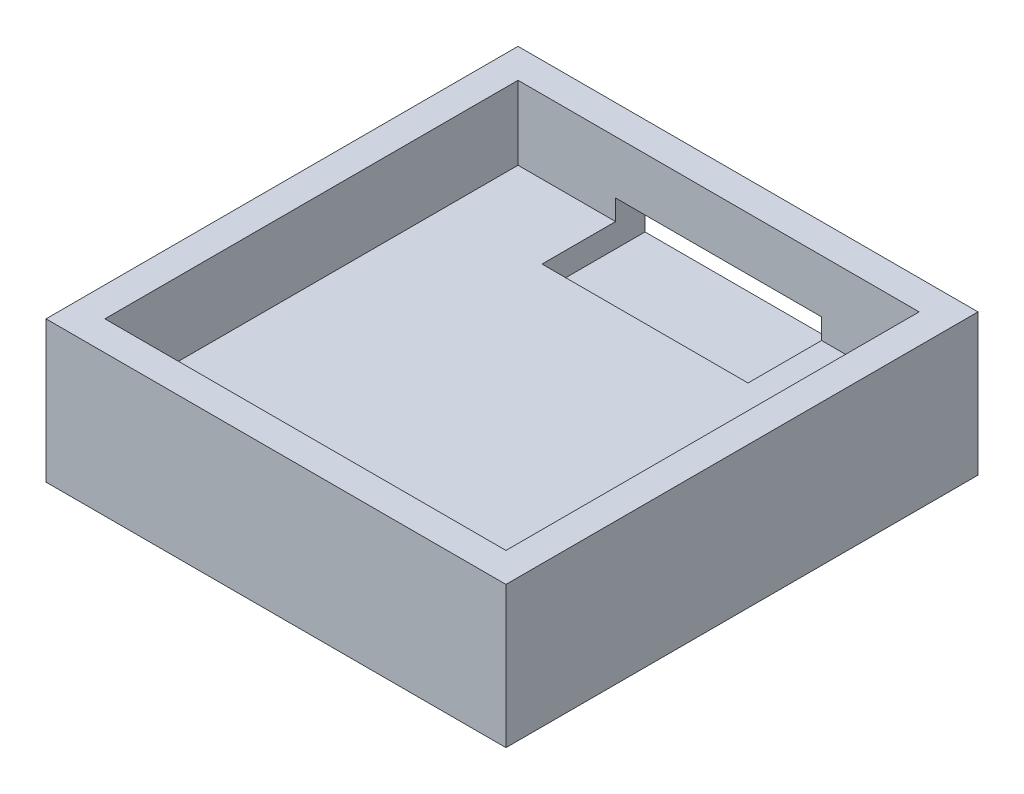
ISO-10303-21;
HEADER;
FILE_DESCRIPTION(('STEP AP214'),'2;1');
FILE_NAME('part.step','',(''),(''),'','','');
FILE_SCHEMA(('AUTOMOTIVE_DESIGN { 1 0 10303 214 1 1 1 1 }'));
ENDSEC;
DATA;
#1=APPLICATION_CONTEXT('core data for automotive mechanical design processes');
#2=APPLICATION_PROTOCOL_DEFINITION('international standard','automotive_design',2000,#1);
#3=PRODUCT_CONTEXT('',#1,'mechanical');
#4=PRODUCT('Part','Part','',(#3));
#5=PRODUCT_RELATED_PRODUCT_CATEGORY('part','',(#4));
#6=PRODUCT_DEFINITION_FORMATION('','',#4);
#7=PRODUCT_DEFINITION_CONTEXT('part definition',#1,'design');
#8=PRODUCT_DEFINITION('design','',#6,#7);
#9=PRODUCT_DEFINITION_SHAPE('','',#8);
#10=(LENGTH_UNIT() NAMED_UNIT(*) SI_UNIT(.MILLI.,.METRE.));
#11=(NAMED_UNIT(*) PLANE_ANGLE_UNIT() SI_UNIT($,.RADIAN.));
#12=(NAMED_UNIT(*) SI_UNIT($,.STERADIAN.) SOLID_ANGLE_UNIT());
#13=UNCERTAINTY_MEASURE_WITH_UNIT(LENGTH_MEASURE(1.E-05),#10,'distance_accuracy_value','');
#14=(GEOMETRIC_REPRESENTATION_CONTEXT(3) GLOBAL_UNCERTAINTY_ASSIGNED_CONTEXT((#13)) GLOBAL_UNIT_ASSIGNED_CONTEXT((#10,
#11,#12)) REPRESENTATION_CONTEXT('',''));
#15=CARTESIAN_POINT('',(0.,0.,0.));
#16=DIRECTION('',(0.,0.,1.));
#17=DIRECTION('',(1.,0.,0.));
#18=AXIS2_PLACEMENT_3D('',#15,#16,#17);
#19=CARTESIAN_POINT('',(-12.8282746478873,1.61,-9.71524647887324));
#20=DIRECTION('',(0.,0.,-1.));
#21=DIRECTION('',(-1.,0.,0.));
#22=AXIS2_PLACEMENT_3D('',#19,#20,#21);
#23=PLANE('',#22);
#24=DIRECTION('',(0.,-1.,0.));
#25=VECTOR('',#24,1.);
#26=CARTESIAN_POINT('',(18.4317253521127,1.61,-9.71524647887324));
#27=LINE('',#26,#25);
#28=CARTESIAN_POINT('',(18.4317253521127,6.61,-9.71524647887324));
#29=VERTEX_POINT('',#28);
#30=CARTESIAN_POINT('',(18.4317253521127,-3.,-9.71524647887324));
#31=VERTEX_POINT('',#30);
#32=EDGE_CURVE('E160',#29,#31,#27,.T.);
#33=ORIENTED_EDGE('',*,*,#32,.T.);
#34=DIRECTION('',(1.,0.,0.));
#35=VECTOR('',#34,1.);
#36=CARTESIAN_POINT('',(-12.8282746478873,-3.,-9.71524647887324));
#37=LINE('',#36,#35);
#38=CARTESIAN_POINT('',(-12.8282746478873,-3.,-9.71524647887324));
#39=VERTEX_POINT('',#38);
#40=EDGE_CURVE('E158',#39,#31,#37,.T.);
#41=ORIENTED_EDGE('',*,*,#40,.F.);
#42=DIRECTION('',(0.,-1.,0.));
#43=VECTOR('',#42,1.);
#44=CARTESIAN_POINT('',(-12.8282746478873,1.61,-9.71524647887324));
#45=LINE('',#44,#43);
#46=CARTESIAN_POINT('',(-12.8282746478873,6.61,-9.71524647887324));
#47=VERTEX_POINT('',#46);
#48=EDGE_CURVE('E143',#47,#39,#45,.T.);
#49=ORIENTED_EDGE('',*,*,#48,.F.);
#50=DIRECTION('',(-1.,0.,0.));
#51=VECTOR('',#50,1.);
#52=CARTESIAN_POINT('',(-12.8282746478873,6.61,-9.71524647887324));
#53=LINE('',#52,#51);
#54=EDGE_CURVE('E270',#29,#47,#53,.T.);
#55=ORIENTED_EDGE('',*,*,#54,.F.);
#56=EDGE_LOOP('',(#33,#41,#49,#55));
#57=FACE_BOUND('',#56,.T.);
#58=DIRECTION('',(1.,0.,0.));
#59=VECTOR('',#58,1.);
#60=CARTESIAN_POINT('',(-12.8282746478873,0.,-9.71524647887324));
#61=LINE('',#60,#59);
#62=CARTESIAN_POINT('',(-4.19827464788733,0.,-9.71524647887324));
#63=VERTEX_POINT('',#62);
#64=CARTESIAN_POINT('',(9.80172535211267,0.,-9.71524647887324));
#65=VERTEX_POINT('',#64);
#66=EDGE_CURVE('E172',#63,#65,#61,.T.);
#67=ORIENTED_EDGE('',*,*,#66,.T.);
#68=DIRECTION('',(0.,1.,0.));
#69=VECTOR('',#68,1.);
#70=CARTESIAN_POINT('',(9.80172535211267,0.,-9.71524647887324));
#71=LINE('',#70,#69);
#72=CARTESIAN_POINT('',(9.80172535211267,3.,-9.71524647887324));
#73=VERTEX_POINT('',#72);
#74=EDGE_CURVE('E194',#65,#73,#71,.T.);
#75=ORIENTED_EDGE('',*,*,#74,.T.);
#76=DIRECTION('',(-1.,0.,0.));
#77=VECTOR('',#76,1.);
#78=CARTESIAN_POINT('',(9.80172535211267,3.,-9.71524647887324));
#79=LINE('',#78,#77);
#80=CARTESIAN_POINT('',(-4.19827464788733,3.,-9.71524647887324));
#81=VERTEX_POINT('',#80);
#82=EDGE_CURVE('E190',#73,#81,#79,.T.);
#83=ORIENTED_EDGE('',*,*,#82,.T.);
#84=DIRECTION('',(0.,1.,0.));
#85=VECTOR('',#84,1.);
#86=CARTESIAN_POINT('',(-4.19827464788733,0.,-9.71524647887324));
#87=LINE('',#86,#85);
#88=EDGE_CURVE('E185',#63,#81,#87,.T.);
#89=ORIENTED_EDGE('',*,*,#88,.F.);
#90=EDGE_LOOP('',(#67,#75,#83,#89));
#91=FACE_BOUND('',#90,.T.);
#92=ADVANCED_FACE('F39',(#57,#91),#23,.T.);
#93=CARTESIAN_POINT('',(-10.8282746478873,6.61,-7.71524647887324));
#94=DIRECTION('',(0.,0.,1.));
#95=DIRECTION('',(1.,0.,0.));
#96=AXIS2_PLACEMENT_3D('',#93,#94,#95);
#97=PLANE('',#96);
#98=DIRECTION('',(1.,0.,0.));
#99=VECTOR('',#98,1.);
#100=CARTESIAN_POINT('',(-10.8282746478873,3.,-7.71524647887324));
#101=LINE('',#100,#99);
#102=CARTESIAN_POINT('',(-4.19827464788733,3.,-7.71524647887324));
#103=VERTEX_POINT('',#102);
#104=CARTESIAN_POINT('',(9.80172535211267,3.,-7.71524647887324));
#105=VERTEX_POINT('',#104);
#106=EDGE_CURVE('E47',#103,#105,#101,.T.);
#107=ORIENTED_EDGE('',*,*,#106,.T.);
#108=DIRECTION('',(0.,-1.,0.));
#109=VECTOR('',#108,1.);
#110=CARTESIAN_POINT('',(9.80172535211267,6.60999999999999,-7.71524647887324));
#111=LINE('',#110,#109);
#112=CARTESIAN_POINT('',(9.80172535211267,1.61,-7.71524647887324));
#113=VERTEX_POINT('',#112);
#114=EDGE_CURVE('E11',#105,#113,#111,.T.);
#115=ORIENTED_EDGE('',*,*,#114,.T.);
#116=DIRECTION('',(-1.,0.,0.));
#117=VECTOR('',#116,1.);
#118=CARTESIAN_POINT('',(-10.8282746478873,1.61,-7.71524647887324));
#119=LINE('',#118,#117);
#120=CARTESIAN_POINT('',(16.4317253521127,1.61,-7.71524647887324));
#121=VERTEX_POINT('',#120);
#122=EDGE_CURVE('E233',#121,#113,#119,.T.);
#123=ORIENTED_EDGE('',*,*,#122,.F.);
#124=DIRECTION('',(0.,-1.,0.));
#125=VECTOR('',#124,1.);
#126=CARTESIAN_POINT('',(16.4317253521127,6.61,-7.71524647887324));
#127=LINE('',#126,#125);
#128=CARTESIAN_POINT('',(16.4317253521127,6.61,-7.71524647887324));
#129=VERTEX_POINT('',#128);
#130=EDGE_CURVE('E62',#129,#121,#127,.T.);
#131=ORIENTED_EDGE('',*,*,#130,.F.);
#132=DIRECTION('',(-1.,0.,0.));
#133=VECTOR('',#132,1.);
#134=CARTESIAN_POINT('',(-10.8282746478873,6.61,-7.71524647887324));
#135=LINE('',#134,#133);
#136=CARTESIAN_POINT('',(-10.8282746478873,6.61,-7.71524647887324));
#137=VERTEX_POINT('',#136);
#138=EDGE_CURVE('E219',#129,#137,#135,.T.);
#139=ORIENTED_EDGE('',*,*,#138,.T.);
#140=DIRECTION('',(0.,-1.,0.));
#141=VECTOR('',#140,1.);
#142=CARTESIAN_POINT('',(-10.8282746478873,6.61,-7.71524647887324));
#143=LINE('',#142,#141);
#144=CARTESIAN_POINT('',(-10.8282746478873,1.61,-7.71524647887324));
#145=VERTEX_POINT('',#144);
#146=EDGE_CURVE('E256',#137,#145,#143,.T.);
#147=ORIENTED_EDGE('',*,*,#146,.T.);
#148=CARTESIAN_POINT('',(-4.19827464788733,1.61,-7.71524647887324));
#149=VERTEX_POINT('',#148);
#150=EDGE_CURVE('E216',#149,#145,#119,.T.);
#151=ORIENTED_EDGE('',*,*,#150,.F.);
#152=DIRECTION('',(0.,-1.,0.));
#153=VECTOR('',#152,1.);
#154=CARTESIAN_POINT('',(-4.19827464788733,6.61,-7.71524647887324));
#155=LINE('',#154,#153);
#156=EDGE_CURVE('E291',#103,#149,#155,.T.);
#157=ORIENTED_EDGE('',*,*,#156,.F.);
#158=EDGE_LOOP('',(#107,#115,#123,#131,#139,#147,#151,#157));
#159=FACE_BOUND('',#158,.T.);
#160=ADVANCED_FACE('F297',(#159),#97,.T.);
#161=CARTESIAN_POINT('',(0.,1.61,0.));
#162=DIRECTION('',(0.,-1.,0.));
#163=DIRECTION('',(0.,0.,-1.));
#164=AXIS2_PLACEMENT_3D('',#161,#162,#163);
#165=PLANE('',#164);
#166=DIRECTION('',(0.,0.,1.));
#167=VECTOR('',#166,1.);
#168=CARTESIAN_POINT('',(-4.19827464788733,1.61,-7.71524647887324));
#169=LINE('',#168,#167);
#170=CARTESIAN_POINT('',(-4.19827464788733,1.61,-2.71524647887324));
#171=VERTEX_POINT('',#170);
#172=EDGE_CURVE('E202',#149,#171,#169,.T.);
#173=ORIENTED_EDGE('',*,*,#172,.F.);
#174=ORIENTED_EDGE('',*,*,#150,.T.);
#175=DIRECTION('',(0.,0.,1.));
#176=VECTOR('',#175,1.);
#177=CARTESIAN_POINT('',(-10.8282746478873,1.61,-7.71524647887324));
#178=LINE('',#177,#176);
#179=CARTESIAN_POINT('',(-10.8282746478873,1.61,20.3647535211268));
#180=VERTEX_POINT('',#179);
#181=EDGE_CURVE('E237',#145,#180,#178,.T.);
#182=ORIENTED_EDGE('',*,*,#181,.T.);
#183=DIRECTION('',(1.,0.,0.));
#184=VECTOR('',#183,1.);
#185=CARTESIAN_POINT('',(-10.8282746478873,1.61,20.3647535211268));
#186=LINE('',#185,#184);
#187=CARTESIAN_POINT('',(16.4317253521127,1.61,20.3647535211268));
#188=VERTEX_POINT('',#187);
#189=EDGE_CURVE('E241',#180,#188,#186,.T.);
#190=ORIENTED_EDGE('',*,*,#189,.T.);
#191=DIRECTION('',(0.,0.,-1.));
#192=VECTOR('',#191,1.);
#193=CARTESIAN_POINT('',(16.4317253521127,1.61,-7.71524647887324));
#194=LINE('',#193,#192);
#195=EDGE_CURVE('E223',#188,#121,#194,.T.);
#196=ORIENTED_EDGE('',*,*,#195,.T.);
#197=ORIENTED_EDGE('',*,*,#122,.T.);
#198=DIRECTION('',(0.,0.,-1.));
#199=VECTOR('',#198,1.);
#200=CARTESIAN_POINT('',(9.80172535211267,1.61,-7.71524647887324));
#201=LINE('',#200,#199);
#202=CARTESIAN_POINT('',(9.80172535211267,1.61,-2.71524647887324));
#203=VERTEX_POINT('',#202);
#204=EDGE_CURVE('E209',#203,#113,#201,.T.);
#205=ORIENTED_EDGE('',*,*,#204,.F.);
#206=DIRECTION('',(1.,0.,0.));
#207=VECTOR('',#206,1.);
#208=CARTESIAN_POINT('',(-4.19827464788733,1.61,-2.71524647887324));
#209=LINE('',#208,#207);
#210=EDGE_CURVE('E54',#171,#203,#209,.T.);
#211=ORIENTED_EDGE('',*,*,#210,.F.);
#212=EDGE_LOOP('',(#173,#174,#182,#190,#196,#197,#205,#211));
#213=FACE_BOUND('',#212,.T.);
#214=ADVANCED_FACE('F314',(#213),#165,.F.);
#215=CARTESIAN_POINT('',(-12.8282746478873,1.61,-9.71524647887324));
#216=DIRECTION('',(1.,0.,0.));
#217=DIRECTION('',(0.,0.,-1.));
#218=AXIS2_PLACEMENT_3D('',#215,#216,#217);
#219=PLANE('',#218);
#220=ORIENTED_EDGE('',*,*,#48,.T.);
#221=DIRECTION('',(0.,0.,-1.));
#222=VECTOR('',#221,1.);
#223=CARTESIAN_POINT('',(-12.8282746478873,-3.,22.3647535211268));
#224=LINE('',#223,#222);
#225=CARTESIAN_POINT('',(-12.8282746478873,-3.,22.3647535211268));
#226=VERTEX_POINT('',#225);
#227=EDGE_CURVE('E147',#226,#39,#224,.T.);
#228=ORIENTED_EDGE('',*,*,#227,.F.);
#229=DIRECTION('',(0.,-1.,0.));
#230=VECTOR('',#229,1.);
#231=CARTESIAN_POINT('',(-12.8282746478873,1.61,22.3647535211268));
#232=LINE('',#231,#230);
#233=CARTESIAN_POINT('',(-12.8282746478873,6.61,22.3647535211268));
#234=VERTEX_POINT('',#233);
#235=EDGE_CURVE('E155',#234,#226,#232,.T.);
#236=ORIENTED_EDGE('',*,*,#235,.F.);
#237=DIRECTION('',(0.,0.,1.));
#238=VECTOR('',#237,1.);
#239=CARTESIAN_POINT('',(-12.8282746478873,6.61,-9.71524647887324));
#240=LINE('',#239,#238);
#241=EDGE_CURVE('E149',#47,#234,#240,.T.);
#242=ORIENTED_EDGE('',*,*,#241,.F.);
#243=EDGE_LOOP('',(#220,#228,#236,#242));
#244=FACE_BOUND('',#243,.T.);
#245=ADVANCED_FACE('F145',(#244),#219,.F.);
#246=CARTESIAN_POINT('',(-12.8282746478873,1.61,22.3647535211268));
#247=DIRECTION('',(0.,0.,-1.));
#248=DIRECTION('',(-1.,0.,0.));
#249=AXIS2_PLACEMENT_3D('',#246,#247,#248);
#250=PLANE('',#249);
#251=ORIENTED_EDGE('',*,*,#235,.T.);
#252=DIRECTION('',(-1.,0.,0.));
#253=VECTOR('',#252,1.);
#254=CARTESIAN_POINT('',(-12.8282746478873,-3.,22.3647535211268));
#255=LINE('',#254,#253);
#256=CARTESIAN_POINT('',(18.4317253521127,-3.,22.3647535211268));
#257=VERTEX_POINT('',#256);
#258=EDGE_CURVE('E170',#257,#226,#255,.T.);
#259=ORIENTED_EDGE('',*,*,#258,.F.);
#260=DIRECTION('',(0.,-1.,0.));
#261=VECTOR('',#260,1.);
#262=CARTESIAN_POINT('',(18.4317253521127,1.61,22.3647535211268));
#263=LINE('',#262,#261);
#264=CARTESIAN_POINT('',(18.4317253521127,6.61,22.3647535211268));
#265=VERTEX_POINT('',#264);
#266=EDGE_CURVE('E275',#265,#257,#263,.T.);
#267=ORIENTED_EDGE('',*,*,#266,.F.);
#268=DIRECTION('',(1.,0.,0.));
#269=VECTOR('',#268,1.);
#270=CARTESIAN_POINT('',(-12.8282746478873,6.61,22.3647535211268));
#271=LINE('',#270,#269);
#272=EDGE_CURVE('E262',#234,#265,#271,.T.);
#273=ORIENTED_EDGE('',*,*,#272,.F.);
#274=EDGE_LOOP('',(#251,#259,#267,#273));
#275=FACE_BOUND('',#274,.T.);
#276=ADVANCED_FACE('F364',(#275),#250,.F.);
#277=CARTESIAN_POINT('',(18.4317253521127,1.61,-9.71524647887324));
#278=DIRECTION('',(1.,0.,0.));
#279=DIRECTION('',(0.,0.,-1.));
#280=AXIS2_PLACEMENT_3D('',#277,#278,#279);
#281=PLANE('',#280);
#282=ORIENTED_EDGE('',*,*,#266,.T.);
#283=DIRECTION('',(0.,0.,1.));
#284=VECTOR('',#283,1.);
#285=CARTESIAN_POINT('',(18.4317253521127,-3.,22.3647535211268));
#286=LINE('',#285,#284);
#287=EDGE_CURVE('E165',#31,#257,#286,.T.);
#288=ORIENTED_EDGE('',*,*,#287,.F.);
#289=ORIENTED_EDGE('',*,*,#32,.F.);
#290=DIRECTION('',(0.,0.,-1.));
#291=VECTOR('',#290,1.);
#292=CARTESIAN_POINT('',(18.4317253521127,6.61,-9.71524647887324));
#293=LINE('',#292,#291);
#294=EDGE_CURVE('E266',#265,#29,#293,.T.);
#295=ORIENTED_EDGE('',*,*,#294,.F.);
#296=EDGE_LOOP('',(#282,#288,#289,#295));
#297=FACE_BOUND('',#296,.T.);
#298=ADVANCED_FACE('F359',(#297),#281,.T.);
#299=CARTESIAN_POINT('',(0.,6.61,0.));
#300=DIRECTION('',(0.,1.,0.));
#301=DIRECTION('',(0.,0.,1.));
#302=AXIS2_PLACEMENT_3D('',#299,#300,#301);
#303=PLANE('',#302);
#304=ORIENTED_EDGE('',*,*,#241,.T.);
#305=ORIENTED_EDGE('',*,*,#272,.T.);
#306=ORIENTED_EDGE('',*,*,#294,.T.);
#307=ORIENTED_EDGE('',*,*,#54,.T.);
#308=EDGE_LOOP('',(#304,#305,#306,#307));
#309=FACE_BOUND('',#308,.T.);
#310=DIRECTION('',(0.,0.,1.));
#311=VECTOR('',#310,1.);
#312=CARTESIAN_POINT('',(-10.8282746478873,6.61,-7.71524647887324));
#313=LINE('',#312,#311);
#314=CARTESIAN_POINT('',(-10.8282746478873,6.61,20.3647535211268));
#315=VERTEX_POINT('',#314);
#316=EDGE_CURVE('E222',#137,#315,#313,.T.);
#317=ORIENTED_EDGE('',*,*,#316,.F.);
#318=ORIENTED_EDGE('',*,*,#138,.F.);
#319=DIRECTION('',(0.,0.,-1.));
#320=VECTOR('',#319,1.);
#321=CARTESIAN_POINT('',(16.4317253521127,6.61,-7.71524647887324));
#322=LINE('',#321,#320);
#323=CARTESIAN_POINT('',(16.4317253521127,6.61,20.3647535211268));
#324=VERTEX_POINT('',#323);
#325=EDGE_CURVE('E230',#324,#129,#322,.T.);
#326=ORIENTED_EDGE('',*,*,#325,.F.);
#327=DIRECTION('',(1.,0.,0.));
#328=VECTOR('',#327,1.);
#329=CARTESIAN_POINT('',(-10.8282746478873,6.61,20.3647535211268));
#330=LINE('',#329,#328);
#331=EDGE_CURVE('E226',#315,#324,#330,.T.);
#332=ORIENTED_EDGE('',*,*,#331,.F.);
#333=EDGE_LOOP('',(#317,#318,#326,#332));
#334=FACE_BOUND('',#333,.T.);
#335=ADVANCED_FACE('F320',(#309,#334),#303,.T.);
#336=CARTESIAN_POINT('',(-10.8282746478873,6.61,-7.71524647887324));
#337=DIRECTION('',(1.,0.,0.));
#338=DIRECTION('',(0.,0.,-1.));
#339=AXIS2_PLACEMENT_3D('',#336,#337,#338);
#340=PLANE('',#339);
#341=ORIENTED_EDGE('',*,*,#181,.F.);
#342=ORIENTED_EDGE('',*,*,#146,.F.);
#343=ORIENTED_EDGE('',*,*,#316,.T.);
#344=DIRECTION('',(0.,-1.,0.));
#345=VECTOR('',#344,1.);
#346=CARTESIAN_POINT('',(-10.8282746478873,6.61,20.3647535211268));
#347=LINE('',#346,#345);
#348=EDGE_CURVE('E253',#315,#180,#347,.T.);
#349=ORIENTED_EDGE('',*,*,#348,.T.);
#350=EDGE_LOOP('',(#341,#342,#343,#349));
#351=FACE_BOUND('',#350,.T.);
#352=ADVANCED_FACE('F325',(#351),#340,.T.);
#353=CARTESIAN_POINT('',(-10.8282746478873,6.61,20.3647535211268));
#354=DIRECTION('',(0.,0.,-1.));
#355=DIRECTION('',(-1.,0.,0.));
#356=AXIS2_PLACEMENT_3D('',#353,#354,#355);
#357=PLANE('',#356);
#358=ORIENTED_EDGE('',*,*,#189,.F.);
#359=ORIENTED_EDGE('',*,*,#348,.F.);
#360=ORIENTED_EDGE('',*,*,#331,.T.);
#361=DIRECTION('',(0.,-1.,0.));
#362=VECTOR('',#361,1.);
#363=CARTESIAN_POINT('',(16.4317253521127,6.61,20.3647535211268));
#364=LINE('',#363,#362);
#365=EDGE_CURVE('E250',#324,#188,#364,.T.);
#366=ORIENTED_EDGE('',*,*,#365,.T.);
#367=EDGE_LOOP('',(#358,#359,#360,#366));
#368=FACE_BOUND('',#367,.T.);
#369=ADVANCED_FACE('F328',(#368),#357,.T.);
#370=CARTESIAN_POINT('',(16.4317253521127,6.61,-7.71524647887324));
#371=DIRECTION('',(-1.,0.,0.));
#372=DIRECTION('',(0.,0.,1.));
#373=AXIS2_PLACEMENT_3D('',#370,#371,#372);
#374=PLANE('',#373);
#375=ORIENTED_EDGE('',*,*,#195,.F.);
#376=ORIENTED_EDGE('',*,*,#365,.F.);
#377=ORIENTED_EDGE('',*,*,#325,.T.);
#378=ORIENTED_EDGE('',*,*,#130,.T.);
#379=EDGE_LOOP('',(#375,#376,#377,#378));
#380=FACE_BOUND('',#379,.T.);
#381=ADVANCED_FACE('F391',(#380),#374,.T.);
#382=CARTESIAN_POINT('',(-4.19827464788733,-3.39,-7.71524647887324));
#383=DIRECTION('',(-1.,0.,0.));
#384=DIRECTION('',(0.,0.,1.));
#385=AXIS2_PLACEMENT_3D('',#382,#383,#384);
#386=PLANE('',#385);
#387=ORIENTED_EDGE('',*,*,#172,.T.);
#388=DIRECTION('',(0.,1.,0.));
#389=VECTOR('',#388,1.);
#390=CARTESIAN_POINT('',(-4.19827464788733,-3.39,-2.71524647887324));
#391=LINE('',#390,#389);
#392=CARTESIAN_POINT('',(-4.19827464788733,0.,-2.71524647887324));
#393=VERTEX_POINT('',#392);
#394=EDGE_CURVE('E212',#393,#171,#391,.T.);
#395=ORIENTED_EDGE('',*,*,#394,.F.);
#396=DIRECTION('',(0.,0.,-1.));
#397=VECTOR('',#396,1.);
#398=CARTESIAN_POINT('',(-4.19827464788733,0.,0.));
#399=LINE('',#398,#397);
#400=EDGE_CURVE('E287',#393,#63,#399,.T.);
#401=ORIENTED_EDGE('',*,*,#400,.T.);
#402=ORIENTED_EDGE('',*,*,#88,.T.);
#403=DIRECTION('',(0.,0.,-1.));
#404=VECTOR('',#403,1.);
#405=CARTESIAN_POINT('',(-4.19827464788733,3.,-4.71524647887324));
#406=LINE('',#405,#404);
#407=EDGE_CURVE('E198',#103,#81,#406,.T.);
#408=ORIENTED_EDGE('',*,*,#407,.F.);
#409=ORIENTED_EDGE('',*,*,#156,.T.);
#410=EDGE_LOOP('',(#387,#395,#401,#402,#408,#409));
#411=FACE_BOUND('',#410,.T.);
#412=ADVANCED_FACE('F305',(#411),#386,.F.);
#413=CARTESIAN_POINT('',(9.80172535211267,-3.39,-7.71524647887324));
#414=DIRECTION('',(1.,0.,0.));
#415=DIRECTION('',(0.,0.,-1.));
#416=AXIS2_PLACEMENT_3D('',#413,#414,#415);
#417=PLANE('',#416);
#418=DIRECTION('',(0.,0.,1.));
#419=VECTOR('',#418,1.);
#420=CARTESIAN_POINT('',(9.80172535211267,0.,0.));
#421=LINE('',#420,#419);
#422=CARTESIAN_POINT('',(9.80172535211267,0.,-2.71524647887324));
#423=VERTEX_POINT('',#422);
#424=EDGE_CURVE('E283',#65,#423,#421,.T.);
#425=ORIENTED_EDGE('',*,*,#424,.T.);
#426=DIRECTION('',(0.,1.,0.));
#427=VECTOR('',#426,1.);
#428=CARTESIAN_POINT('',(9.80172535211267,-3.39,-2.71524647887324));
#429=LINE('',#428,#427);
#430=EDGE_CURVE('E213',#423,#203,#429,.T.);
#431=ORIENTED_EDGE('',*,*,#430,.T.);
#432=ORIENTED_EDGE('',*,*,#204,.T.);
#433=ORIENTED_EDGE('',*,*,#114,.F.);
#434=DIRECTION('',(0.,0.,-1.));
#435=VECTOR('',#434,1.);
#436=CARTESIAN_POINT('',(9.80172535211267,3.,-4.71524647887324));
#437=LINE('',#436,#435);
#438=EDGE_CURVE('E199',#105,#73,#437,.T.);
#439=ORIENTED_EDGE('',*,*,#438,.T.);
#440=ORIENTED_EDGE('',*,*,#74,.F.);
#441=EDGE_LOOP('',(#425,#431,#432,#433,#439,#440));
#442=FACE_BOUND('',#441,.T.);
#443=ADVANCED_FACE('F311',(#442),#417,.F.);
#444=CARTESIAN_POINT('',(-4.19827464788733,-3.39,-2.71524647887324));
#445=DIRECTION('',(0.,0.,1.));
#446=DIRECTION('',(1.,0.,0.));
#447=AXIS2_PLACEMENT_3D('',#444,#445,#446);
#448=PLANE('',#447);
#449=DIRECTION('',(-1.,0.,0.));
#450=VECTOR('',#449,1.);
#451=CARTESIAN_POINT('',(0.,0.,-2.71524647887324));
#452=LINE('',#451,#450);
#453=EDGE_CURVE('E154',#423,#393,#452,.T.);
#454=ORIENTED_EDGE('',*,*,#453,.T.);
#455=ORIENTED_EDGE('',*,*,#394,.T.);
#456=ORIENTED_EDGE('',*,*,#210,.T.);
#457=ORIENTED_EDGE('',*,*,#430,.F.);
#458=EDGE_LOOP('',(#454,#455,#456,#457));
#459=FACE_BOUND('',#458,.T.);
#460=ADVANCED_FACE('F330',(#459),#448,.F.);
#461=CARTESIAN_POINT('',(9.80172535211267,3.,-4.71524647887324));
#462=DIRECTION('',(0.,-1.,0.));
#463=DIRECTION('',(0.,0.,-1.));
#464=AXIS2_PLACEMENT_3D('',#461,#462,#463);
#465=PLANE('',#464);
#466=ORIENTED_EDGE('',*,*,#407,.T.);
#467=ORIENTED_EDGE('',*,*,#82,.F.);
#468=ORIENTED_EDGE('',*,*,#438,.F.);
#469=ORIENTED_EDGE('',*,*,#106,.F.);
#470=EDGE_LOOP('',(#466,#467,#468,#469));
#471=FACE_BOUND('',#470,.T.);
#472=ADVANCED_FACE('F302',(#471),#465,.T.);
#473=CARTESIAN_POINT('',(0.,-3.,0.));
#474=DIRECTION('',(0.,-1.,0.));
#475=DIRECTION('',(0.,0.,-1.));
#476=AXIS2_PLACEMENT_3D('',#473,#474,#475);
#477=PLANE('',#476);
#478=CARTESIAN_POINT('',(2.80172535211267,-3.,15.6447535211268));
#479=DIRECTION('',(0.,-1.,0.));
#480=DIRECTION('',(0.,0.,-1.));
#481=AXIS2_PLACEMENT_3D('',#478,#479,#480);
#482=CIRCLE('',#481,2.5);
#483=CARTESIAN_POINT('',(2.80172535211267,-3.,13.1447535211268));
#484=VERTEX_POINT('',#483);
#485=EDGE_CURVE('E508',#484,#484,#482,.T.);
#486=ORIENTED_EDGE('',*,*,#485,.F.);
#487=EDGE_LOOP('',(#486));
#488=FACE_BOUND('',#487,.T.);
#489=CARTESIAN_POINT('',(11.1017253521127,-3.,6.32475352112676));
#490=DIRECTION('',(0.,-1.,0.));
#491=DIRECTION('',(0.,0.,-1.));
#492=AXIS2_PLACEMENT_3D('',#489,#490,#491);
#493=CIRCLE('',#492,2.5);
#494=CARTESIAN_POINT('',(11.1017253521127,-3.,3.82475352112676));
#495=VERTEX_POINT('',#494);
#496=EDGE_CURVE('E518',#495,#495,#493,.T.);
#497=ORIENTED_EDGE('',*,*,#496,.F.);
#498=EDGE_LOOP('',(#497));
#499=FACE_BOUND('',#498,.T.);
#500=CARTESIAN_POINT('',(-5.49827464788733,-3.,6.32475352112676));
#501=DIRECTION('',(0.,-1.,0.));
#502=DIRECTION('',(0.,0.,-1.));
#503=AXIS2_PLACEMENT_3D('',#500,#501,#502);
#504=CIRCLE('',#503,2.5);
#505=CARTESIAN_POINT('',(-5.49827464788733,-3.,3.82475352112676));
#506=VERTEX_POINT('',#505);
#507=EDGE_CURVE('E526',#506,#506,#504,.T.);
#508=ORIENTED_EDGE('',*,*,#507,.F.);
#509=EDGE_LOOP('',(#508));
#510=FACE_BOUND('',#509,.T.);
#511=CARTESIAN_POINT('',(2.80172535211267,-3.,-2.99524647887324));
#512=DIRECTION('',(0.,-1.,0.));
#513=DIRECTION('',(0.,0.,-1.));
#514=AXIS2_PLACEMENT_3D('',#511,#512,#513);
#515=CIRCLE('',#514,2.5);
#516=CARTESIAN_POINT('',(2.80172535211267,-3.,-5.49524647887324));
#517=VERTEX_POINT('',#516);
#518=EDGE_CURVE('E179',#517,#517,#515,.T.);
#519=ORIENTED_EDGE('',*,*,#518,.F.);
#520=EDGE_LOOP('',(#519));
#521=FACE_BOUND('',#520,.T.);
#522=ORIENTED_EDGE('',*,*,#227,.T.);
#523=ORIENTED_EDGE('',*,*,#40,.T.);
#524=ORIENTED_EDGE('',*,*,#287,.T.);
#525=ORIENTED_EDGE('',*,*,#258,.T.);
#526=EDGE_LOOP('',(#522,#523,#524,#525));
#527=FACE_BOUND('',#526,.T.);
#528=ADVANCED_FACE('F168',(#488,#499,#510,#521,#527),#477,.T.);
#529=CARTESIAN_POINT('',(0.,0.,0.));
#530=DIRECTION('',(0.,-1.,0.));
#531=DIRECTION('',(0.,0.,-1.));
#532=AXIS2_PLACEMENT_3D('',#529,#530,#531);
#533=PLANE('',#532);
#534=ORIENTED_EDGE('',*,*,#424,.F.);
#535=ORIENTED_EDGE('',*,*,#66,.F.);
#536=ORIENTED_EDGE('',*,*,#400,.F.);
#537=ORIENTED_EDGE('',*,*,#453,.F.);
#538=EDGE_LOOP('',(#534,#535,#536,#537));
#539=FACE_BOUND('',#538,.T.);
#540=ADVANCED_FACE('F332',(#539),#533,.F.);
#541=CARTESIAN_POINT('',(2.80172535211267,-1.,-2.99524647887324));
#542=DIRECTION('',(0.,-1.,0.));
#543=DIRECTION('',(0.,0.,-1.));
#544=AXIS2_PLACEMENT_3D('',#541,#542,#543);
#545=CYLINDRICAL_SURFACE('',#544,2.5);
#546=CARTESIAN_POINT('',(2.80172535211267,-1.,-2.99524647887324));
#547=DIRECTION('',(0.,-1.,0.));
#548=DIRECTION('',(0.,0.,-1.));
#549=AXIS2_PLACEMENT_3D('',#546,#547,#548);
#550=CIRCLE('',#549,2.5);
#551=CARTESIAN_POINT('',(2.80172535211267,-1.,-5.49524647887324));
#552=VERTEX_POINT('',#551);
#553=EDGE_CURVE('E529',#552,#552,#550,.T.);
#554=ORIENTED_EDGE('',*,*,#553,.F.);
#555=EDGE_LOOP('',(#554));
#556=FACE_BOUND('',#555,.T.);
#557=ORIENTED_EDGE('',*,*,#518,.T.);
#558=EDGE_LOOP('',(#557));
#559=FACE_BOUND('',#558,.T.);
#560=ADVANCED_FACE('F334',(#556,#559),#545,.F.);
#561=CARTESIAN_POINT('',(2.80172535211267,-1.,-2.99524647887324));
#562=DIRECTION('',(0.,-1.,0.));
#563=DIRECTION('',(0.,0.,-1.));
#564=AXIS2_PLACEMENT_3D('',#561,#562,#563);
#565=PLANE('',#564);
#566=ORIENTED_EDGE('',*,*,#553,.T.);
#567=EDGE_LOOP('',(#566));
#568=FACE_BOUND('',#567,.T.);
#569=ADVANCED_FACE('F340',(#568),#565,.T.);
#570=CARTESIAN_POINT('',(-5.49827464788733,-1.,6.32475352112676));
#571=DIRECTION('',(0.,-1.,0.));
#572=DIRECTION('',(0.,0.,-1.));
#573=AXIS2_PLACEMENT_3D('',#570,#571,#572);
#574=CYLINDRICAL_SURFACE('',#573,2.5);
#575=CARTESIAN_POINT('',(-5.49827464788733,-1.,6.32475352112676));
#576=DIRECTION('',(0.,-1.,0.));
#577=DIRECTION('',(0.,0.,-1.));
#578=AXIS2_PLACEMENT_3D('',#575,#576,#577);
#579=CIRCLE('',#578,2.5);
#580=CARTESIAN_POINT('',(-5.49827464788733,-1.,3.82475352112676));
#581=VERTEX_POINT('',#580);
#582=EDGE_CURVE('E522',#581,#581,#579,.T.);
#583=ORIENTED_EDGE('',*,*,#582,.F.);
#584=EDGE_LOOP('',(#583));
#585=FACE_BOUND('',#584,.T.);
#586=ORIENTED_EDGE('',*,*,#507,.T.);
#587=EDGE_LOOP('',(#586));
#588=FACE_BOUND('',#587,.T.);
#589=ADVANCED_FACE('F441',(#585,#588),#574,.F.);
#590=CARTESIAN_POINT('',(-5.49827464788733,-1.,6.32475352112676));
#591=DIRECTION('',(0.,-1.,0.));
#592=DIRECTION('',(0.,0.,-1.));
#593=AXIS2_PLACEMENT_3D('',#590,#591,#592);
#594=PLANE('',#593);
#595=ORIENTED_EDGE('',*,*,#582,.T.);
#596=EDGE_LOOP('',(#595));
#597=FACE_BOUND('',#596,.T.);
#598=ADVANCED_FACE('F451',(#597),#594,.T.);
#599=CARTESIAN_POINT('',(11.1017253521127,-1.,6.32475352112676));
#600=DIRECTION('',(0.,-1.,0.));
#601=DIRECTION('',(0.,0.,-1.));
#602=AXIS2_PLACEMENT_3D('',#599,#600,#601);
#603=CYLINDRICAL_SURFACE('',#602,2.5);
#604=CARTESIAN_POINT('',(11.1017253521127,-1.,6.32475352112676));
#605=DIRECTION('',(0.,-1.,0.));
#606=DIRECTION('',(0.,0.,-1.));
#607=AXIS2_PLACEMENT_3D('',#604,#605,#606);
#608=CIRCLE('',#607,2.5);
#609=CARTESIAN_POINT('',(11.1017253521127,-1.,3.82475352112676));
#610=VERTEX_POINT('',#609);
#611=EDGE_CURVE('E512',#610,#610,#608,.T.);
#612=ORIENTED_EDGE('',*,*,#611,.F.);
#613=EDGE_LOOP('',(#612));
#614=FACE_BOUND('',#613,.T.);
#615=ORIENTED_EDGE('',*,*,#496,.T.);
#616=EDGE_LOOP('',(#615));
#617=FACE_BOUND('',#616,.T.);
#618=ADVANCED_FACE('F461',(#614,#617),#603,.F.);
#619=CARTESIAN_POINT('',(11.1017253521127,-1.,6.32475352112676));
#620=DIRECTION('',(0.,-1.,0.));
#621=DIRECTION('',(0.,0.,-1.));
#622=AXIS2_PLACEMENT_3D('',#619,#620,#621);
#623=PLANE('',#622);
#624=ORIENTED_EDGE('',*,*,#611,.T.);
#625=EDGE_LOOP('',(#624));
#626=FACE_BOUND('',#625,.T.);
#627=ADVANCED_FACE('F471',(#626),#623,.T.);
#628=CARTESIAN_POINT('',(2.80172535211267,-1.,15.6447535211268));
#629=DIRECTION('',(0.,-1.,0.));
#630=DIRECTION('',(0.,0.,-1.));
#631=AXIS2_PLACEMENT_3D('',#628,#629,#630);
#632=CYLINDRICAL_SURFACE('',#631,2.5);
#633=CARTESIAN_POINT('',(2.80172535211267,-1.,15.6447535211268));
#634=DIRECTION('',(0.,-1.,0.));
#635=DIRECTION('',(0.,0.,-1.));
#636=AXIS2_PLACEMENT_3D('',#633,#634,#635);
#637=CIRCLE('',#636,2.5);
#638=CARTESIAN_POINT('',(2.80172535211267,-1.,13.1447535211268));
#639=VERTEX_POINT('',#638);
#640=EDGE_CURVE('E176',#639,#639,#637,.T.);
#641=ORIENTED_EDGE('',*,*,#640,.F.);
#642=EDGE_LOOP('',(#641));
#643=FACE_BOUND('',#642,.T.);
#644=ORIENTED_EDGE('',*,*,#485,.T.);
#645=EDGE_LOOP('',(#644));
#646=FACE_BOUND('',#645,.T.);
#647=ADVANCED_FACE('F481',(#643,#646),#632,.F.);
#648=CARTESIAN_POINT('',(2.80172535211267,-1.,15.6447535211268));
#649=DIRECTION('',(0.,-1.,0.));
#650=DIRECTION('',(0.,0.,-1.));
#651=AXIS2_PLACEMENT_3D('',#648,#649,#650);
#652=PLANE('',#651);
#653=ORIENTED_EDGE('',*,*,#640,.T.);
#654=EDGE_LOOP('',(#653));
#655=FACE_BOUND('',#654,.T.);
#656=ADVANCED_FACE('F491',(#655),#652,.T.);
#657=CLOSED_SHELL('',(#92,#160,#214,#245,#276,#298,#335,#352,#369,#381,#412,#443,#460,#472,#528,
#540,#560,#569,#589,#598,#618,#627,#647,#656));
#658=MANIFOLD_SOLID_BREP('B2',#657);
#659=ADVANCED_BREP_SHAPE_REPRESENTATION('',(#18,#658),#14);
#660=SHAPE_DEFINITION_REPRESENTATION(#9,#659);
ENDSEC;
END-ISO-10303-21;
